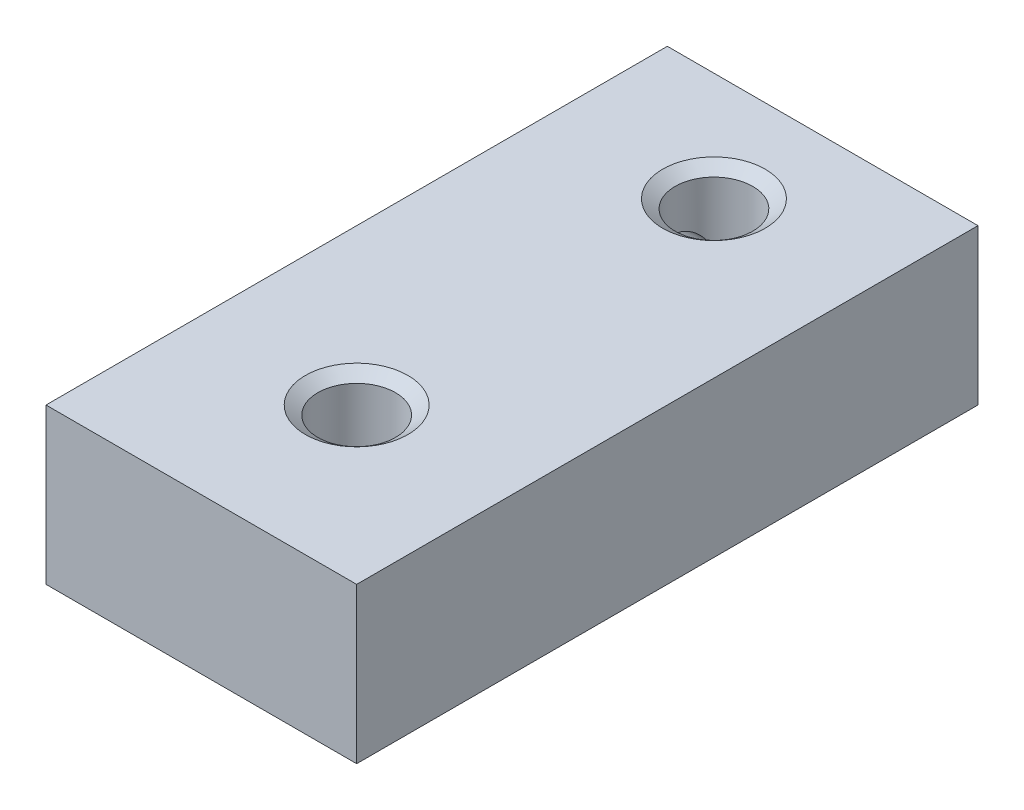
ISO-10303-21;
HEADER;
FILE_DESCRIPTION(('STEP AP214'),'2;1');
FILE_NAME('part.step','',(''),(''),'','','');
FILE_SCHEMA(('AUTOMOTIVE_DESIGN { 1 0 10303 214 1 1 1 1 }'));
ENDSEC;
DATA;
#1=APPLICATION_CONTEXT('core data for automotive mechanical design processes');
#2=APPLICATION_PROTOCOL_DEFINITION('international standard','automotive_design',2000,#1);
#3=PRODUCT_CONTEXT('',#1,'mechanical');
#4=PRODUCT('Part','Part','',(#3));
#5=PRODUCT_RELATED_PRODUCT_CATEGORY('part','',(#4));
#6=PRODUCT_DEFINITION_FORMATION('','',#4);
#7=PRODUCT_DEFINITION_CONTEXT('part definition',#1,'design');
#8=PRODUCT_DEFINITION('design','',#6,#7);
#9=PRODUCT_DEFINITION_SHAPE('','',#8);
#10=(LENGTH_UNIT() NAMED_UNIT(*) SI_UNIT(.MILLI.,.METRE.));
#11=(NAMED_UNIT(*) PLANE_ANGLE_UNIT() SI_UNIT($,.RADIAN.));
#12=(NAMED_UNIT(*) SI_UNIT($,.STERADIAN.) SOLID_ANGLE_UNIT());
#13=UNCERTAINTY_MEASURE_WITH_UNIT(LENGTH_MEASURE(1.E-05),#10,'distance_accuracy_value','');
#14=(GEOMETRIC_REPRESENTATION_CONTEXT(3) GLOBAL_UNCERTAINTY_ASSIGNED_CONTEXT((#13)) GLOBAL_UNIT_ASSIGNED_CONTEXT((#10,
#11,#12)) REPRESENTATION_CONTEXT('',''));
#15=CARTESIAN_POINT('',(0.,0.,0.));
#16=DIRECTION('',(0.,0.,1.));
#17=DIRECTION('',(1.,0.,0.));
#18=AXIS2_PLACEMENT_3D('',#15,#16,#17);
#19=CARTESIAN_POINT('',(0.,0.,20.));
#20=DIRECTION('',(1.,0.,0.));
#21=DIRECTION('',(0.,0.,-1.));
#22=AXIS2_PLACEMENT_3D('',#19,#20,#21);
#23=PLANE('',#22);
#24=CARTESIAN_POINT('',(0.,2.5,3.5));
#25=DIRECTION('',(-1.,0.,0.));
#26=DIRECTION('',(0.,0.,1.));
#27=AXIS2_PLACEMENT_3D('',#24,#25,#26);
#28=CIRCLE('',#27,1.27);
#29=CARTESIAN_POINT('',(0.,2.5,4.77));
#30=VERTEX_POINT('',#29);
#31=EDGE_CURVE('E179',#30,#30,#28,.T.);
#32=ORIENTED_EDGE('',*,*,#31,.F.);
#33=EDGE_LOOP('',(#32));
#34=FACE_BOUND('',#33,.T.);
#35=CARTESIAN_POINT('',(0.,2.5,12.));
#36=DIRECTION('',(-1.,0.,0.));
#37=DIRECTION('',(0.,0.,1.));
#38=AXIS2_PLACEMENT_3D('',#35,#36,#37);
#39=CIRCLE('',#38,1.27);
#40=CARTESIAN_POINT('',(0.,2.5,13.27));
#41=VERTEX_POINT('',#40);
#42=EDGE_CURVE('E107',#41,#41,#39,.T.);
#43=ORIENTED_EDGE('',*,*,#42,.F.);
#44=EDGE_LOOP('',(#43));
#45=FACE_BOUND('',#44,.T.);
#46=DIRECTION('',(0.,-1.,0.));
#47=VECTOR('',#46,1.);
#48=CARTESIAN_POINT('',(0.,0.,0.));
#49=LINE('',#48,#47);
#50=CARTESIAN_POINT('',(0.,5.,0.));
#51=VERTEX_POINT('',#50);
#52=CARTESIAN_POINT('',(0.,0.,0.));
#53=VERTEX_POINT('',#52);
#54=EDGE_CURVE('E131',#51,#53,#49,.T.);
#55=ORIENTED_EDGE('',*,*,#54,.T.);
#56=DIRECTION('',(0.,0.,-1.));
#57=VECTOR('',#56,1.);
#58=CARTESIAN_POINT('',(0.,0.,20.));
#59=LINE('',#58,#57);
#60=CARTESIAN_POINT('',(0.,0.,20.));
#61=VERTEX_POINT('',#60);
#62=EDGE_CURVE('E11',#61,#53,#59,.T.);
#63=ORIENTED_EDGE('',*,*,#62,.F.);
#64=DIRECTION('',(0.,-1.,0.));
#65=VECTOR('',#64,1.);
#66=CARTESIAN_POINT('',(0.,0.,20.));
#67=LINE('',#66,#65);
#68=CARTESIAN_POINT('',(0.,5.,20.));
#69=VERTEX_POINT('',#68);
#70=EDGE_CURVE('E132',#69,#61,#67,.T.);
#71=ORIENTED_EDGE('',*,*,#70,.F.);
#72=DIRECTION('',(0.,0.,-1.));
#73=VECTOR('',#72,1.);
#74=CARTESIAN_POINT('',(0.,5.,20.));
#75=LINE('',#74,#73);
#76=EDGE_CURVE('E138',#69,#51,#75,.T.);
#77=ORIENTED_EDGE('',*,*,#76,.T.);
#78=EDGE_LOOP('',(#55,#63,#71,#77));
#79=FACE_BOUND('',#78,.T.);
#80=ADVANCED_FACE('F34',(#34,#45,#79),#23,.F.);
#81=CARTESIAN_POINT('',(0.,0.,20.));
#82=DIRECTION('',(0.,1.,0.));
#83=DIRECTION('',(0.,0.,1.));
#84=AXIS2_PLACEMENT_3D('',#81,#82,#83);
#85=PLANE('',#84);
#86=CARTESIAN_POINT('',(5.,0.,15.));
#87=DIRECTION('',(0.,-1.,0.));
#88=DIRECTION('',(0.,0.,-1.));
#89=AXIS2_PLACEMENT_3D('',#86,#87,#88);
#90=CIRCLE('',#89,1.65);
#91=CARTESIAN_POINT('',(5.,0.,13.35));
#92=VERTEX_POINT('',#91);
#93=EDGE_CURVE('E104',#92,#92,#90,.T.);
#94=ORIENTED_EDGE('',*,*,#93,.F.);
#95=EDGE_LOOP('',(#94));
#96=FACE_BOUND('',#95,.T.);
#97=CARTESIAN_POINT('',(5.,0.,3.5));
#98=DIRECTION('',(0.,-1.,0.));
#99=DIRECTION('',(0.,0.,-1.));
#100=AXIS2_PLACEMENT_3D('',#97,#98,#99);
#101=CIRCLE('',#100,1.65);
#102=CARTESIAN_POINT('',(5.,0.,1.85));
#103=VERTEX_POINT('',#102);
#104=EDGE_CURVE('E122',#103,#103,#101,.T.);
#105=ORIENTED_EDGE('',*,*,#104,.F.);
#106=EDGE_LOOP('',(#105));
#107=FACE_BOUND('',#106,.T.);
#108=DIRECTION('',(1.,0.,0.));
#109=VECTOR('',#108,1.);
#110=CARTESIAN_POINT('',(0.,0.,0.));
#111=LINE('',#110,#109);
#112=CARTESIAN_POINT('',(10.,0.,0.));
#113=VERTEX_POINT('',#112);
#114=EDGE_CURVE('E141',#53,#113,#111,.T.);
#115=ORIENTED_EDGE('',*,*,#114,.T.);
#116=DIRECTION('',(0.,0.,-1.));
#117=VECTOR('',#116,1.);
#118=CARTESIAN_POINT('',(10.,0.,20.));
#119=LINE('',#118,#117);
#120=CARTESIAN_POINT('',(10.,0.,20.));
#121=VERTEX_POINT('',#120);
#122=EDGE_CURVE('E47',#121,#113,#119,.T.);
#123=ORIENTED_EDGE('',*,*,#122,.F.);
#124=DIRECTION('',(1.,0.,0.));
#125=VECTOR('',#124,1.);
#126=CARTESIAN_POINT('',(0.,0.,20.));
#127=LINE('',#126,#125);
#128=EDGE_CURVE('E86',#61,#121,#127,.T.);
#129=ORIENTED_EDGE('',*,*,#128,.F.);
#130=ORIENTED_EDGE('',*,*,#62,.T.);
#131=EDGE_LOOP('',(#115,#123,#129,#130));
#132=FACE_BOUND('',#131,.T.);
#133=ADVANCED_FACE('F166',(#96,#107,#132),#85,.F.);
#134=CARTESIAN_POINT('',(10.,0.,20.));
#135=DIRECTION('',(-1.,0.,0.));
#136=DIRECTION('',(0.,0.,1.));
#137=AXIS2_PLACEMENT_3D('',#134,#135,#136);
#138=PLANE('',#137);
#139=DIRECTION('',(0.,1.,0.));
#140=VECTOR('',#139,1.);
#141=CARTESIAN_POINT('',(10.,0.,0.));
#142=LINE('',#141,#140);
#143=CARTESIAN_POINT('',(10.,5.,0.));
#144=VERTEX_POINT('',#143);
#145=EDGE_CURVE('E73',#113,#144,#142,.T.);
#146=ORIENTED_EDGE('',*,*,#145,.T.);
#147=DIRECTION('',(0.,0.,-1.));
#148=VECTOR('',#147,1.);
#149=CARTESIAN_POINT('',(10.,5.,20.));
#150=LINE('',#149,#148);
#151=CARTESIAN_POINT('',(10.,5.,20.));
#152=VERTEX_POINT('',#151);
#153=EDGE_CURVE('E146',#152,#144,#150,.T.);
#154=ORIENTED_EDGE('',*,*,#153,.F.);
#155=DIRECTION('',(0.,1.,0.));
#156=VECTOR('',#155,1.);
#157=CARTESIAN_POINT('',(10.,0.,20.));
#158=LINE('',#157,#156);
#159=EDGE_CURVE('E135',#121,#152,#158,.T.);
#160=ORIENTED_EDGE('',*,*,#159,.F.);
#161=ORIENTED_EDGE('',*,*,#122,.T.);
#162=EDGE_LOOP('',(#146,#154,#160,#161));
#163=FACE_BOUND('',#162,.T.);
#164=ADVANCED_FACE('F149',(#163),#138,.F.);
#165=CARTESIAN_POINT('',(0.,5.,20.));
#166=DIRECTION('',(0.,-1.,0.));
#167=DIRECTION('',(0.,0.,-1.));
#168=AXIS2_PLACEMENT_3D('',#165,#166,#167);
#169=PLANE('',#168);
#170=CARTESIAN_POINT('',(5.,5.,15.));
#171=DIRECTION('',(0.,-1.,0.));
#172=DIRECTION('',(0.,0.,-1.));
#173=AXIS2_PLACEMENT_3D('',#170,#171,#172);
#174=CIRCLE('',#173,1.65);
#175=CARTESIAN_POINT('',(5.,5.,13.35));
#176=VERTEX_POINT('',#175);
#177=EDGE_CURVE('E100',#176,#176,#174,.T.);
#178=ORIENTED_EDGE('',*,*,#177,.T.);
#179=EDGE_LOOP('',(#178));
#180=FACE_BOUND('',#179,.T.);
#181=CARTESIAN_POINT('',(5.,5.,3.5));
#182=DIRECTION('',(0.,-1.,0.));
#183=DIRECTION('',(0.,0.,-1.));
#184=AXIS2_PLACEMENT_3D('',#181,#182,#183);
#185=CIRCLE('',#184,1.65);
#186=CARTESIAN_POINT('',(5.,5.,1.85));
#187=VERTEX_POINT('',#186);
#188=EDGE_CURVE('E119',#187,#187,#185,.T.);
#189=ORIENTED_EDGE('',*,*,#188,.T.);
#190=EDGE_LOOP('',(#189));
#191=FACE_BOUND('',#190,.T.);
#192=DIRECTION('',(-1.,0.,0.));
#193=VECTOR('',#192,1.);
#194=CARTESIAN_POINT('',(0.,5.,0.));
#195=LINE('',#194,#193);
#196=EDGE_CURVE('E79',#144,#51,#195,.T.);
#197=ORIENTED_EDGE('',*,*,#196,.T.);
#198=ORIENTED_EDGE('',*,*,#76,.F.);
#199=DIRECTION('',(-1.,0.,0.));
#200=VECTOR('',#199,1.);
#201=CARTESIAN_POINT('',(0.,5.,20.));
#202=LINE('',#201,#200);
#203=EDGE_CURVE('E55',#152,#69,#202,.T.);
#204=ORIENTED_EDGE('',*,*,#203,.F.);
#205=ORIENTED_EDGE('',*,*,#153,.T.);
#206=EDGE_LOOP('',(#197,#198,#204,#205));
#207=FACE_BOUND('',#206,.T.);
#208=ADVANCED_FACE('F156',(#180,#191,#207),#169,.F.);
#209=CARTESIAN_POINT('',(0.,5.,20.));
#210=DIRECTION('',(0.,0.,-1.));
#211=DIRECTION('',(-1.,0.,0.));
#212=AXIS2_PLACEMENT_3D('',#209,#210,#211);
#213=PLANE('',#212);
#214=ORIENTED_EDGE('',*,*,#70,.T.);
#215=ORIENTED_EDGE('',*,*,#128,.T.);
#216=ORIENTED_EDGE('',*,*,#159,.T.);
#217=ORIENTED_EDGE('',*,*,#203,.T.);
#218=EDGE_LOOP('',(#214,#215,#216,#217));
#219=FACE_BOUND('',#218,.T.);
#220=ADVANCED_FACE('F158',(#219),#213,.F.);
#221=CARTESIAN_POINT('',(0.,5.,0.));
#222=DIRECTION('',(0.,0.,-1.));
#223=DIRECTION('',(-1.,0.,0.));
#224=AXIS2_PLACEMENT_3D('',#221,#222,#223);
#225=PLANE('',#224);
#226=ORIENTED_EDGE('',*,*,#54,.F.);
#227=ORIENTED_EDGE('',*,*,#196,.F.);
#228=ORIENTED_EDGE('',*,*,#145,.F.);
#229=ORIENTED_EDGE('',*,*,#114,.F.);
#230=EDGE_LOOP('',(#226,#227,#228,#229));
#231=FACE_BOUND('',#230,.T.);
#232=ADVANCED_FACE('F152',(#231),#225,.T.);
#233=CARTESIAN_POINT('',(5.,4.71991698471612,3.5));
#234=DIRECTION('',(0.,1.,0.));
#235=DIRECTION('',(0.,0.,1.));
#236=AXIS2_PLACEMENT_3D('',#233,#234,#235);
#237=CONICAL_SURFACE('',#236,1.25,0.959931088596882);
#238=ORIENTED_EDGE('',*,*,#188,.F.);
#239=EDGE_LOOP('',(#238));
#240=FACE_BOUND('',#239,.T.);
#241=CARTESIAN_POINT('',(5.,4.71991698471612,3.5));
#242=DIRECTION('',(0.,-1.,0.));
#243=DIRECTION('',(0.,0.,-1.));
#244=AXIS2_PLACEMENT_3D('',#241,#242,#243);
#245=CIRCLE('',#244,1.25);
#246=CARTESIAN_POINT('',(5.,4.71991698471612,2.25));
#247=VERTEX_POINT('',#246);
#248=EDGE_CURVE('E128',#247,#247,#245,.T.);
#249=ORIENTED_EDGE('',*,*,#248,.T.);
#250=EDGE_LOOP('',(#249));
#251=FACE_BOUND('',#250,.T.);
#252=ADVANCED_FACE('F225',(#240,#251),#237,.F.);
#253=CARTESIAN_POINT('',(5.,0.,3.5));
#254=DIRECTION('',(0.,-1.,0.));
#255=DIRECTION('',(0.,0.,-1.));
#256=AXIS2_PLACEMENT_3D('',#253,#254,#255);
#257=CYLINDRICAL_SURFACE('',#256,1.25);
#258=CARTESIAN_POINT('',(4.12126283793161,2.5,4.38899999999999));
#259=CARTESIAN_POINT('',(4.12126295680263,2.54242386609414,4.38900018980173));
#260=CARTESIAN_POINT('',(4.11812978018003,2.58484672746559,4.38593505192402));
#261=CARTESIAN_POINT('',(4.10628598808362,2.66810272583433,4.37397989222581));
#262=CARTESIAN_POINT('',(4.097562006086,2.70893180355087,4.3650759096785));
#263=CARTESIAN_POINT('',(4.07620706190932,2.78745861354023,4.34222625800087));
#264=CARTESIAN_POINT('',(4.06362241628532,2.82518708060094,4.32834004281814));
#265=CARTESIAN_POINT('',(4.03604711130191,2.89768213603106,4.29608111427695));
#266=CARTESIAN_POINT('',(4.02105647994578,2.93244875886618,4.27770845313496));
#267=CARTESIAN_POINT('',(3.98710095393089,3.00496793977451,4.23311406578023));
#268=CARTESIAN_POINT('',(3.96790963434675,3.04211010534736,4.2060721199123));
#269=CARTESIAN_POINT('',(3.92961413522528,3.11187875279909,4.14655263139337));
#270=CARTESIAN_POINT('',(3.91051010289514,3.14449925138184,4.11406800985289));
#271=CARTESIAN_POINT('',(3.8706423188609,3.20996966772869,4.03778389638612));
#272=CARTESIAN_POINT('',(3.85017030624617,3.2418671242439,3.99299912298308));
#273=CARTESIAN_POINT('',(3.81360540319922,3.297362534494,3.89697622829095));
#274=CARTESIAN_POINT('',(3.79750341998125,3.32097775162127,3.84575183628501));
#275=CARTESIAN_POINT('',(3.77525677428088,3.35317657062002,3.75319352802488));
#276=CARTESIAN_POINT('',(3.76759020226004,3.36411049696244,3.71303663839996));
#277=CARTESIAN_POINT('',(3.75620259102019,3.38027653837554,3.63105328857714));
#278=CARTESIAN_POINT('',(3.75247834253082,3.38551329135828,3.58922821520255));
#279=CARTESIAN_POINT('',(3.74929830302821,3.38998774456208,3.50500596084663));
#280=CARTESIAN_POINT('',(3.7498513965489,3.38921295810963,3.46260777176025));
#281=CARTESIAN_POINT('',(3.7551956955828,3.38168342856205,3.37861569295935));
#282=CARTESIAN_POINT('',(3.75998804262693,3.3749270747716,3.33702202296576));
#283=CARTESIAN_POINT('',(3.77322271048962,3.35606490642809,3.25683542101087));
#284=CARTESIAN_POINT('',(3.78156965750111,3.34409870225358,3.21819320283623));
#285=CARTESIAN_POINT('',(3.80127502275025,3.31539635339083,3.143559070178));
#286=CARTESIAN_POINT('',(3.81263404855506,3.29865924631145,3.10756769226966));
#287=CARTESIAN_POINT('',(3.83904000738926,3.25887772087251,3.03488815616696));
#288=CARTESIAN_POINT('',(3.85435714761161,3.23533761790926,2.99857118512535));
#289=CARTESIAN_POINT('',(3.88678262300744,3.18372317572236,2.93019099362157));
#290=CARTESIAN_POINT('',(3.90389279329528,3.15564417480831,2.89813220887804));
#291=CARTESIAN_POINT('',(3.94201288409218,3.08991917508186,2.83304276764636));
#292=CARTESIAN_POINT('',(3.96316292674028,3.05146291361907,2.8009102855967));
#293=CARTESIAN_POINT('',(4.0044235502862,2.9693155774916,2.7433097612115));
#294=CARTESIAN_POINT('',(4.02453423431258,2.92562502362345,2.71784105665146));
#295=CARTESIAN_POINT('',(4.05697718480917,2.84377582790957,2.67921112566457));
#296=CARTESIAN_POINT('',(4.07003908322338,2.80661049768694,2.66456859771891));
#297=CARTESIAN_POINT('',(4.0924900589398,2.72965732325969,2.64023205076936));
#298=CARTESIAN_POINT('',(4.10188595594111,2.68987451098587,2.6305288330386));
#299=CARTESIAN_POINT('',(4.11557948155341,2.60797348952866,2.61659619508724));
#300=CARTESIAN_POINT('',(4.11981847967736,2.56583401887962,2.61242967513138));
#301=CARTESIAN_POINT('',(4.12207701939438,2.48123446899481,2.61019344829598));
#302=CARTESIAN_POINT('',(4.12010047990068,2.43877460860821,2.61211989978593));
#303=CARTESIAN_POINT('',(4.11114671942614,2.36170934074452,2.62109861401032));
#304=CARTESIAN_POINT('',(4.10498571419451,2.32690061417846,2.62731659385886));
#305=CARTESIAN_POINT('',(4.08940074304185,2.2589445057243,2.64359123437703));
#306=CARTESIAN_POINT('',(4.07997303300377,2.22579908034217,2.65365230114172));
#307=CARTESIAN_POINT('',(4.05376724424427,2.14616842450116,2.68287872804901));
#308=CARTESIAN_POINT('',(4.03563034071386,2.10088625441734,2.70409697039225));
#309=CARTESIAN_POINT('',(3.99710578153042,2.01513909687917,2.75321937873522));
#310=CARTESIAN_POINT('',(3.97671368429729,1.97468395388864,2.78113686996581));
#311=CARTESIAN_POINT('',(3.93537532497114,1.89808198390314,2.84386188808036));
#312=CARTESIAN_POINT('',(3.91442667898789,1.86204840849058,2.87880644773999));
#313=CARTESIAN_POINT('',(3.87433394368426,1.79598900385886,2.9548229299791));
#314=CARTESIAN_POINT('',(3.85518735216385,1.7659547773078,2.99588614556113));
#315=CARTESIAN_POINT('',(3.82305649594964,1.71686179817402,3.07702219981319));
#316=CARTESIAN_POINT('',(3.80957826528732,1.69683047884362,3.1163078200049));
#317=CARTESIAN_POINT('',(3.78619769870188,1.6625668225384,3.1983405991132));
#318=CARTESIAN_POINT('',(3.7762932962612,1.64833113370615,3.24108574004462));
#319=CARTESIAN_POINT('',(3.76089734662776,1.62635326146621,3.32929801648256));
#320=CARTESIAN_POINT('',(3.75543358852837,1.61865195657826,3.3747804087454));
#321=CARTESIAN_POINT('',(3.74959656256153,1.61042778937942,3.46670947436397));
#322=CARTESIAN_POINT('',(3.74922076915584,1.60990136563637,3.51315565785002));
#323=CARTESIAN_POINT('',(3.75335725690208,1.61572527378161,3.6004484174323));
#324=CARTESIAN_POINT('',(3.75735997593675,1.62135870659957,3.64137048760245));
#325=CARTESIAN_POINT('',(3.76911812757729,1.6380682347954,3.72151989237685));
#326=CARTESIAN_POINT('',(3.77687421566408,1.64914528084034,3.76074692966));
#327=CARTESIAN_POINT('',(3.79579288201033,1.67657007131502,3.83763096085536));
#328=CARTESIAN_POINT('',(3.80703888446513,1.69304751990406,3.87522049763246));
#329=CARTESIAN_POINT('',(3.83207844457439,1.73054803136457,3.9471133851779));
#330=CARTESIAN_POINT('',(3.84587247180441,1.75157193222395,3.98141612845044));
#331=CARTESIAN_POINT('',(3.87745283278956,1.80117556359357,4.05143547051832));
#332=CARTESIAN_POINT('',(3.89552665217147,1.83042105141368,4.08654971326026));
#333=CARTESIAN_POINT('',(3.93267398789748,1.89364930327254,4.1517101760544));
#334=CARTESIAN_POINT('',(3.95174936922889,1.92764111571647,4.18174646782318));
#335=CARTESIAN_POINT('',(3.99262002223651,2.00608904269853,4.2410721435592));
#336=CARTESIAN_POINT('',(4.01432961339682,2.05134263782232,4.2693758843677));
#337=CARTESIAN_POINT('',(4.05417950313944,2.14744510271142,4.3178679421558));
#338=CARTESIAN_POINT('',(4.07232716391741,2.19828208533015,4.33807309030933));
#339=CARTESIAN_POINT('',(4.09755578359613,2.29103946867183,4.36507051891607));
#340=CARTESIAN_POINT('',(4.10628363486059,2.33187984102313,4.37397779500186));
#341=CARTESIAN_POINT('',(4.11812923687358,2.41515034481261,4.38593422636431));
#342=CARTESIAN_POINT('',(4.12126271905931,2.45757567477853,4.3889998101962));
#343=CARTESIAN_POINT('',(4.12126283793161,2.5,4.38899999999999));
#344=B_SPLINE_CURVE_WITH_KNOTS('',3,(#258,#259,#260,#261,#262,#263,#264,#265,#266,#267,#268,
#269,#270,#271,#272,#273,#274,#275,#276,#277,#278,#279,#280,#281,#282,#283,#284,#285,#286,#287,
#288,#289,#290,#291,#292,#293,#294,#295,#296,#297,#298,#299,#300,#301,#302,#303,#304,#305,#306,
#307,#308,#309,#310,#311,#312,#313,#314,#315,#316,#317,#318,#319,#320,#321,#322,#323,#324,#325,
#326,#327,#328,#329,#330,#331,#332,#333,#334,#335,#336,#337,#338,#339,#340,#341,#342,#343),
.UNSPECIFIED.,.T.,.F.,(4,2,2,2,2,2,2,2,2,2,2,2,2,2,2,2,2,2,2,2,2,2,2,2,2,2,2,2,2,2,2,2,2,2,2,2,
2,2,2,2,2,2,4),(0.,0.127069827677692,0.254444593647276,0.38034733988657,0.506248620849046,
0.655092857964154,0.804132210443166,0.979168139745905,1.15383702725327,1.28025240978783,
1.40656480385252,1.53313963372454,1.65974855758985,1.78315551375333,1.90658738132518,
2.04380586654547,2.1811661885132,2.3436941940057,2.50620604185429,2.63185355930332,
2.75726621298227,2.88409178550881,3.01083741020634,3.11808149041924,3.22544889670886,
3.3841746966419,3.54321886809079,3.70573293642493,3.86801791363091,4.00579099082995,
4.14348427447088,4.28203273382013,4.42051241866149,4.54443856534853,4.6683863620668,
4.79556086990367,4.92275883815882,5.06963631147418,5.21679771564312,5.38885030648415,
5.56054344571058,5.68797355145283,5.81504475432887),.UNSPECIFIED.);
#345=CARTESIAN_POINT('',(4.12126283793161,2.5,4.38899999999999));
#346=VERTEX_POINT('',#345);
#347=EDGE_CURVE('E37',#346,#346,#344,.T.);
#348=ORIENTED_EDGE('',*,*,#347,.T.);
#349=EDGE_LOOP('',(#348));
#350=FACE_BOUND('',#349,.T.);
#351=ORIENTED_EDGE('',*,*,#248,.F.);
#352=EDGE_LOOP('',(#351));
#353=FACE_BOUND('',#352,.T.);
#354=CARTESIAN_POINT('',(5.,0.280083015283884,3.5));
#355=DIRECTION('',(0.,-1.,0.));
#356=DIRECTION('',(0.,0.,-1.));
#357=AXIS2_PLACEMENT_3D('',#354,#355,#356);
#358=CIRCLE('',#357,1.25);
#359=CARTESIAN_POINT('',(5.,0.280083015283884,2.25));
#360=VERTEX_POINT('',#359);
#361=EDGE_CURVE('E125',#360,#360,#358,.T.);
#362=ORIENTED_EDGE('',*,*,#361,.T.);
#363=EDGE_LOOP('',(#362));
#364=FACE_BOUND('',#363,.T.);
#365=ADVANCED_FACE('F220',(#350,#353,#364),#257,.F.);
#366=CARTESIAN_POINT('',(5.,0.,3.5));
#367=DIRECTION('',(0.,-1.,0.));
#368=DIRECTION('',(0.,0.,-1.));
#369=AXIS2_PLACEMENT_3D('',#366,#367,#368);
#370=CONICAL_SURFACE('',#369,1.65,0.959931088596878);
#371=ORIENTED_EDGE('',*,*,#361,.F.);
#372=EDGE_LOOP('',(#371));
#373=FACE_BOUND('',#372,.T.);
#374=ORIENTED_EDGE('',*,*,#104,.T.);
#375=EDGE_LOOP('',(#374));
#376=FACE_BOUND('',#375,.T.);
#377=ADVANCED_FACE('F217',(#373,#376),#370,.F.);
#378=CARTESIAN_POINT('',(5.,4.71991698471612,15.));
#379=DIRECTION('',(0.,1.,0.));
#380=DIRECTION('',(0.,0.,1.));
#381=AXIS2_PLACEMENT_3D('',#378,#379,#380);
#382=CONICAL_SURFACE('',#381,1.25,0.959931088596882);
#383=ORIENTED_EDGE('',*,*,#177,.F.);
#384=EDGE_LOOP('',(#383));
#385=FACE_BOUND('',#384,.T.);
#386=CARTESIAN_POINT('',(5.,4.71991698471612,15.));
#387=DIRECTION('',(0.,-1.,0.));
#388=DIRECTION('',(0.,0.,-1.));
#389=AXIS2_PLACEMENT_3D('',#386,#387,#388);
#390=CIRCLE('',#389,1.25);
#391=CARTESIAN_POINT('',(5.,4.71991698471612,13.75));
#392=VERTEX_POINT('',#391);
#393=EDGE_CURVE('E116',#392,#392,#390,.T.);
#394=ORIENTED_EDGE('',*,*,#393,.T.);
#395=EDGE_LOOP('',(#394));
#396=FACE_BOUND('',#395,.T.);
#397=ADVANCED_FACE('F213',(#385,#396),#382,.F.);
#398=CARTESIAN_POINT('',(5.,0.,15.));
#399=DIRECTION('',(0.,-1.,0.));
#400=DIRECTION('',(0.,0.,-1.));
#401=AXIS2_PLACEMENT_3D('',#398,#399,#400);
#402=CYLINDRICAL_SURFACE('',#401,1.25);
#403=ORIENTED_EDGE('',*,*,#393,.F.);
#404=EDGE_LOOP('',(#403));
#405=FACE_BOUND('',#404,.T.);
#406=CARTESIAN_POINT('',(5.,0.280083015283884,15.));
#407=DIRECTION('',(0.,-1.,0.));
#408=DIRECTION('',(0.,0.,-1.));
#409=AXIS2_PLACEMENT_3D('',#406,#407,#408);
#410=CIRCLE('',#409,1.25);
#411=CARTESIAN_POINT('',(5.,0.280083015283884,13.75));
#412=VERTEX_POINT('',#411);
#413=EDGE_CURVE('E113',#412,#412,#410,.T.);
#414=ORIENTED_EDGE('',*,*,#413,.T.);
#415=EDGE_LOOP('',(#414));
#416=FACE_BOUND('',#415,.T.);
#417=ADVANCED_FACE('F209',(#405,#416),#402,.F.);
#418=CARTESIAN_POINT('',(5.,0.,15.));
#419=DIRECTION('',(0.,-1.,0.));
#420=DIRECTION('',(0.,0.,-1.));
#421=AXIS2_PLACEMENT_3D('',#418,#419,#420);
#422=CONICAL_SURFACE('',#421,1.65,0.959931088596878);
#423=ORIENTED_EDGE('',*,*,#413,.F.);
#424=EDGE_LOOP('',(#423));
#425=FACE_BOUND('',#424,.T.);
#426=ORIENTED_EDGE('',*,*,#93,.T.);
#427=EDGE_LOOP('',(#426));
#428=FACE_BOUND('',#427,.T.);
#429=ADVANCED_FACE('F94',(#425,#428),#422,.F.);
#430=CARTESIAN_POINT('',(5.5,2.5,12.));
#431=DIRECTION('',(-1.,0.,0.));
#432=DIRECTION('',(0.,0.,1.));
#433=AXIS2_PLACEMENT_3D('',#430,#431,#432);
#434=CONICAL_SURFACE('',#433,0.888999999999998,1.02974425867665);
#435=CARTESIAN_POINT('',(6.0341650903155,2.5,12.));
#436=VERTEX_POINT('',#435);
#437=VERTEX_LOOP('',#436);
#438=FACE_BOUND('',#437,.T.);
#439=CARTESIAN_POINT('',(5.5,2.5,12.));
#440=DIRECTION('',(-1.,0.,0.));
#441=DIRECTION('',(0.,0.,1.));
#442=AXIS2_PLACEMENT_3D('',#439,#440,#441);
#443=CIRCLE('',#442,0.888999999999998);
#444=CARTESIAN_POINT('',(5.5,2.5,12.889));
#445=VERTEX_POINT('',#444);
#446=EDGE_CURVE('E98',#445,#445,#443,.T.);
#447=ORIENTED_EDGE('',*,*,#446,.T.);
#448=EDGE_LOOP('',(#447));
#449=FACE_BOUND('',#448,.T.);
#450=ADVANCED_FACE('F90',(#438,#449),#434,.F.);
#451=CARTESIAN_POINT('',(0.,2.5,12.));
#452=DIRECTION('',(-1.,0.,0.));
#453=DIRECTION('',(0.,0.,1.));
#454=AXIS2_PLACEMENT_3D('',#451,#452,#453);
#455=CYLINDRICAL_SURFACE('',#454,0.888999999999994);
#456=ORIENTED_EDGE('',*,*,#446,.F.);
#457=EDGE_LOOP('',(#456));
#458=FACE_BOUND('',#457,.T.);
#459=CARTESIAN_POINT('',(0.26677907205791,2.5,12.));
#460=DIRECTION('',(-1.,0.,0.));
#461=DIRECTION('',(0.,0.,1.));
#462=AXIS2_PLACEMENT_3D('',#459,#460,#461);
#463=CIRCLE('',#462,0.888999999999989);
#464=CARTESIAN_POINT('',(0.26677907205791,2.5,12.889));
#465=VERTEX_POINT('',#464);
#466=EDGE_CURVE('E101',#465,#465,#463,.T.);
#467=ORIENTED_EDGE('',*,*,#466,.T.);
#468=EDGE_LOOP('',(#467));
#469=FACE_BOUND('',#468,.T.);
#470=ADVANCED_FACE('F93',(#458,#469),#455,.F.);
#471=CARTESIAN_POINT('',(0.,2.5,12.));
#472=DIRECTION('',(-1.,0.,0.));
#473=DIRECTION('',(0.,0.,1.));
#474=AXIS2_PLACEMENT_3D('',#471,#472,#473);
#475=CONICAL_SURFACE('',#474,1.27,0.959931088596874);
#476=ORIENTED_EDGE('',*,*,#466,.F.);
#477=EDGE_LOOP('',(#476));
#478=FACE_BOUND('',#477,.T.);
#479=ORIENTED_EDGE('',*,*,#42,.T.);
#480=EDGE_LOOP('',(#479));
#481=FACE_BOUND('',#480,.T.);
#482=ADVANCED_FACE('F197',(#478,#481),#475,.F.);
#483=CARTESIAN_POINT('',(0.,2.5,3.5));
#484=DIRECTION('',(-1.,0.,0.));
#485=DIRECTION('',(0.,0.,1.));
#486=AXIS2_PLACEMENT_3D('',#483,#484,#485);
#487=CYLINDRICAL_SURFACE('',#486,0.888999999999994);
#488=CARTESIAN_POINT('',(0.26677907205791,2.5,3.5));
#489=DIRECTION('',(-1.,0.,0.));
#490=DIRECTION('',(0.,0.,1.));
#491=AXIS2_PLACEMENT_3D('',#488,#489,#490);
#492=CIRCLE('',#491,0.888999999999989);
#493=CARTESIAN_POINT('',(0.26677907205791,2.5,4.38899999999999));
#494=VERTEX_POINT('',#493);
#495=EDGE_CURVE('E184',#494,#494,#492,.T.);
#496=ORIENTED_EDGE('',*,*,#495,.T.);
#497=EDGE_LOOP('',(#496));
#498=FACE_BOUND('',#497,.T.);
#499=ORIENTED_EDGE('',*,*,#347,.F.);
#500=EDGE_LOOP('',(#499));
#501=FACE_BOUND('',#500,.T.);
#502=ADVANCED_FACE('F191',(#498,#501),#487,.F.);
#503=CARTESIAN_POINT('',(0.,2.5,3.5));
#504=DIRECTION('',(-1.,0.,0.));
#505=DIRECTION('',(0.,0.,1.));
#506=AXIS2_PLACEMENT_3D('',#503,#504,#505);
#507=CONICAL_SURFACE('',#506,1.27,0.959931088596874);
#508=ORIENTED_EDGE('',*,*,#495,.F.);
#509=EDGE_LOOP('',(#508));
#510=FACE_BOUND('',#509,.T.);
#511=ORIENTED_EDGE('',*,*,#31,.T.);
#512=EDGE_LOOP('',(#511));
#513=FACE_BOUND('',#512,.T.);
#514=ADVANCED_FACE('F189',(#510,#513),#507,.F.);
#515=CLOSED_SHELL('',(#80,#133,#164,#208,#220,#232,#252,#365,#377,#397,#417,#429,#450,#470,#482,
#502,#514));
#516=MANIFOLD_SOLID_BREP('B2',#515);
#517=ADVANCED_BREP_SHAPE_REPRESENTATION('',(#18,#516),#14);
#518=SHAPE_DEFINITION_REPRESENTATION(#9,#517);
ENDSEC;
END-ISO-10303-21;
